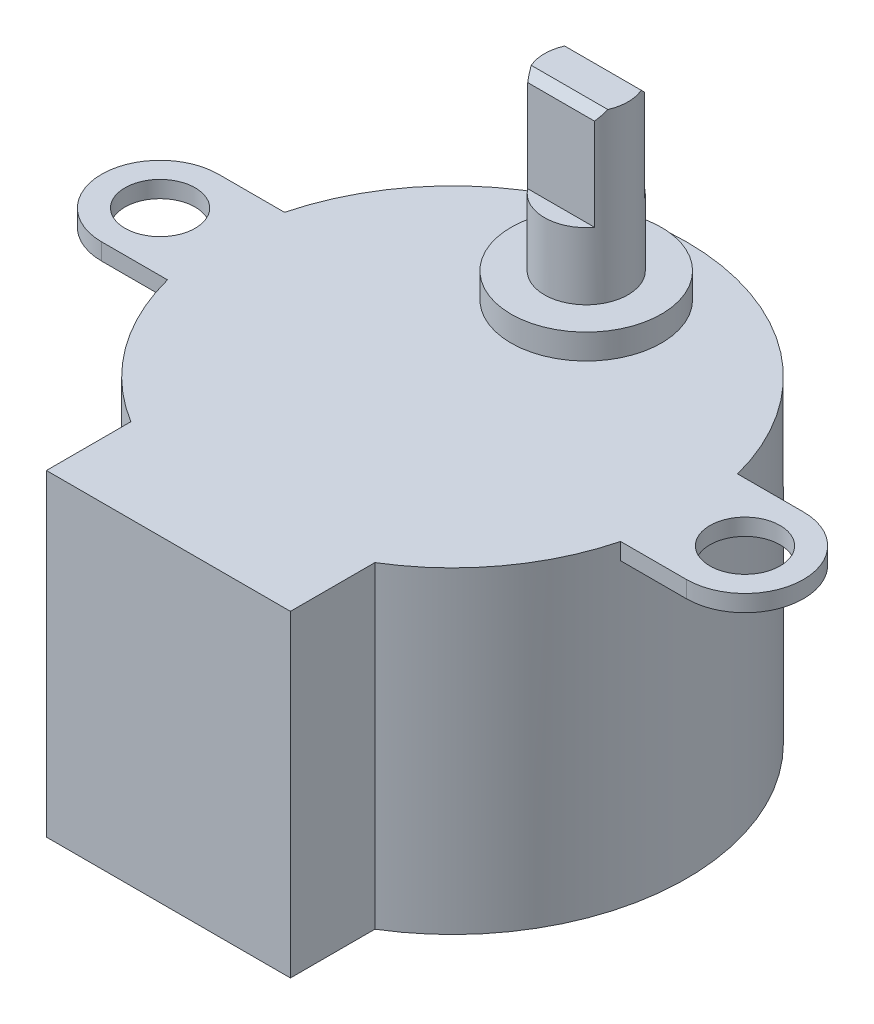
ISO-10303-21;
HEADER;
FILE_DESCRIPTION(('STEP AP214'),'2;1');
FILE_NAME('part.step','',(''),(''),'','','');
FILE_SCHEMA(('AUTOMOTIVE_DESIGN { 1 0 10303 214 1 1 1 1 }'));
ENDSEC;
DATA;
#1=APPLICATION_CONTEXT('core data for automotive mechanical design processes');
#2=APPLICATION_PROTOCOL_DEFINITION('international standard','automotive_design',2000,#1);
#3=PRODUCT_CONTEXT('',#1,'mechanical');
#4=PRODUCT('Part','Part','',(#3));
#5=PRODUCT_RELATED_PRODUCT_CATEGORY('part','',(#4));
#6=PRODUCT_DEFINITION_FORMATION('','',#4);
#7=PRODUCT_DEFINITION_CONTEXT('part definition',#1,'design');
#8=PRODUCT_DEFINITION('design','',#6,#7);
#9=PRODUCT_DEFINITION_SHAPE('','',#8);
#10=(LENGTH_UNIT() NAMED_UNIT(*) SI_UNIT(.MILLI.,.METRE.));
#11=(NAMED_UNIT(*) PLANE_ANGLE_UNIT() SI_UNIT($,.RADIAN.));
#12=(NAMED_UNIT(*) SI_UNIT($,.STERADIAN.) SOLID_ANGLE_UNIT());
#13=UNCERTAINTY_MEASURE_WITH_UNIT(LENGTH_MEASURE(1.E-05),#10,'distance_accuracy_value','');
#14=(GEOMETRIC_REPRESENTATION_CONTEXT(3) GLOBAL_UNCERTAINTY_ASSIGNED_CONTEXT((#13)) GLOBAL_UNIT_ASSIGNED_CONTEXT((#10,
#11,#12)) REPRESENTATION_CONTEXT('',''));
#15=CARTESIAN_POINT('',(0.,0.,0.));
#16=DIRECTION('',(0.,0.,1.));
#17=DIRECTION('',(1.,0.,0.));
#18=AXIS2_PLACEMENT_3D('',#15,#16,#17);
#19=CARTESIAN_POINT('',(0.,19.,0.));
#20=DIRECTION('',(0.,-1.,0.));
#21=DIRECTION('',(0.,0.,-1.));
#22=AXIS2_PLACEMENT_3D('',#19,#20,#21);
#23=CYLINDRICAL_SURFACE('',#22,14.);
#24=CARTESIAN_POINT('',(0.,19.,0.));
#25=DIRECTION('',(0.,1.,0.));
#26=DIRECTION('',(0.,0.,1.));
#27=AXIS2_PLACEMENT_3D('',#24,#25,#26);
#28=CIRCLE('',#27,14.);
#29=CARTESIAN_POINT('',(7.3,19.,11.9461290801665));
#30=VERTEX_POINT('',#29);
#31=CARTESIAN_POINT('',(13.555441711726,19.,3.5));
#32=VERTEX_POINT('',#31);
#33=EDGE_CURVE('E58',#30,#32,#28,.T.);
#34=ORIENTED_EDGE('',*,*,#33,.F.);
#35=DIRECTION('',(0.,1.,0.));
#36=VECTOR('',#35,1.);
#37=CARTESIAN_POINT('',(7.3,-15.449971238625,11.9461290801665));
#38=LINE('',#37,#36);
#39=CARTESIAN_POINT('',(7.3,0.,11.9461290801665));
#40=VERTEX_POINT('',#39);
#41=EDGE_CURVE('E197',#40,#30,#38,.T.);
#42=ORIENTED_EDGE('',*,*,#41,.F.);
#43=CARTESIAN_POINT('',(0.,0.,0.));
#44=DIRECTION('',(0.,1.,0.));
#45=DIRECTION('',(0.,0.,1.));
#46=AXIS2_PLACEMENT_3D('',#43,#44,#45);
#47=CIRCLE('',#46,14.);
#48=CARTESIAN_POINT('',(-7.3,0.,11.9461290801665));
#49=VERTEX_POINT('',#48);
#50=EDGE_CURVE('E345',#40,#49,#47,.T.);
#51=ORIENTED_EDGE('',*,*,#50,.T.);
#52=DIRECTION('',(0.,1.,0.));
#53=VECTOR('',#52,1.);
#54=CARTESIAN_POINT('',(-7.3,-15.449971238625,11.9461290801665));
#55=LINE('',#54,#53);
#56=CARTESIAN_POINT('',(-7.3,19.,11.9461290801665));
#57=VERTEX_POINT('',#56);
#58=EDGE_CURVE('E65',#49,#57,#55,.T.);
#59=ORIENTED_EDGE('',*,*,#58,.T.);
#60=CARTESIAN_POINT('',(-13.555441711726,19.,3.5));
#61=VERTEX_POINT('',#60);
#62=EDGE_CURVE('E189',#61,#57,#28,.T.);
#63=ORIENTED_EDGE('',*,*,#62,.F.);
#64=DIRECTION('',(0.,1.,0.));
#65=VECTOR('',#64,1.);
#66=CARTESIAN_POINT('',(-13.555441711726,18.,3.5));
#67=LINE('',#66,#65);
#68=CARTESIAN_POINT('',(-13.555441711726,18.,3.5));
#69=VERTEX_POINT('',#68);
#70=EDGE_CURVE('E301',#69,#61,#67,.T.);
#71=ORIENTED_EDGE('',*,*,#70,.F.);
#72=CARTESIAN_POINT('',(-4.05925293378573E-13,18.,0.));
#73=DIRECTION('',(0.,-1.,0.));
#74=DIRECTION('',(0.,0.,1.));
#75=AXIS2_PLACEMENT_3D('',#72,#73,#74);
#76=CIRCLE('',#75,13.9999999999996);
#77=CARTESIAN_POINT('',(-13.555441711726,18.,-3.5));
#78=VERTEX_POINT('',#77);
#79=EDGE_CURVE('E275',#69,#78,#76,.T.);
#80=ORIENTED_EDGE('',*,*,#79,.T.);
#81=DIRECTION('',(0.,1.,0.));
#82=VECTOR('',#81,1.);
#83=CARTESIAN_POINT('',(-13.555441711726,18.,-3.5));
#84=LINE('',#83,#82);
#85=CARTESIAN_POINT('',(-13.555441711726,19.,-3.5));
#86=VERTEX_POINT('',#85);
#87=EDGE_CURVE('E297',#78,#86,#84,.T.);
#88=ORIENTED_EDGE('',*,*,#87,.T.);
#89=CARTESIAN_POINT('',(13.555441711726,19.,-3.5));
#90=VERTEX_POINT('',#89);
#91=EDGE_CURVE('E249',#90,#86,#28,.T.);
#92=ORIENTED_EDGE('',*,*,#91,.F.);
#93=DIRECTION('',(0.,1.,0.));
#94=VECTOR('',#93,1.);
#95=CARTESIAN_POINT('',(13.555441711726,18.,-3.5));
#96=LINE('',#95,#94);
#97=CARTESIAN_POINT('',(13.555441711726,18.,-3.5));
#98=VERTEX_POINT('',#97);
#99=EDGE_CURVE('E349',#98,#90,#96,.T.);
#100=ORIENTED_EDGE('',*,*,#99,.F.);
#101=CARTESIAN_POINT('',(2.9316826744008E-13,18.,0.));
#102=DIRECTION('',(0.,-1.,0.));
#103=DIRECTION('',(0.,0.,-1.));
#104=AXIS2_PLACEMENT_3D('',#101,#102,#103);
#105=CIRCLE('',#104,13.9999999999997);
#106=CARTESIAN_POINT('',(13.555441711726,18.,3.5));
#107=VERTEX_POINT('',#106);
#108=EDGE_CURVE('E324',#98,#107,#105,.T.);
#109=ORIENTED_EDGE('',*,*,#108,.T.);
#110=DIRECTION('',(0.,1.,0.));
#111=VECTOR('',#110,1.);
#112=CARTESIAN_POINT('',(13.555441711726,18.,3.5));
#113=LINE('',#112,#111);
#114=EDGE_CURVE('E346',#107,#32,#113,.T.);
#115=ORIENTED_EDGE('',*,*,#114,.T.);
#116=EDGE_LOOP('',(#34,#42,#51,#59,#63,#71,#80,#88,#92,#100,#109,#115));
#117=FACE_BOUND('',#116,.T.);
#118=ADVANCED_FACE('F41',(#117),#23,.T.);
#119=CARTESIAN_POINT('',(0.,19.,0.));
#120=DIRECTION('',(0.,1.,0.));
#121=DIRECTION('',(0.,0.,1.));
#122=AXIS2_PLACEMENT_3D('',#119,#120,#121);
#123=PLANE('',#122);
#124=CARTESIAN_POINT('',(0.,19.,-8.));
#125=DIRECTION('',(0.,1.,0.));
#126=DIRECTION('',(0.,0.,1.));
#127=AXIS2_PLACEMENT_3D('',#124,#125,#126);
#128=CIRCLE('',#127,4.5);
#129=CARTESIAN_POINT('',(0.,19.,-3.5));
#130=VERTEX_POINT('',#129);
#131=EDGE_CURVE('E243',#130,#130,#128,.T.);
#132=ORIENTED_EDGE('',*,*,#131,.F.);
#133=EDGE_LOOP('',(#132));
#134=FACE_BOUND('',#133,.T.);
#135=ORIENTED_EDGE('',*,*,#91,.T.);
#136=DIRECTION('',(-1.,0.,0.));
#137=VECTOR('',#136,1.);
#138=CARTESIAN_POINT('',(-17.5,19.,-3.5));
#139=LINE('',#138,#137);
#140=CARTESIAN_POINT('',(-17.5,19.,-3.5));
#141=VERTEX_POINT('',#140);
#142=EDGE_CURVE('E271',#86,#141,#139,.T.);
#143=ORIENTED_EDGE('',*,*,#142,.T.);
#144=CARTESIAN_POINT('',(-17.5,19.,0.));
#145=DIRECTION('',(0.,1.,0.));
#146=DIRECTION('',(0.,0.,1.));
#147=AXIS2_PLACEMENT_3D('',#144,#145,#146);
#148=CIRCLE('',#147,3.5);
#149=CARTESIAN_POINT('',(-17.5,19.,3.5));
#150=VERTEX_POINT('',#149);
#151=EDGE_CURVE('E262',#141,#150,#148,.T.);
#152=ORIENTED_EDGE('',*,*,#151,.T.);
#153=DIRECTION('',(1.,0.,0.));
#154=VECTOR('',#153,1.);
#155=CARTESIAN_POINT('',(-17.5,19.,3.5));
#156=LINE('',#155,#154);
#157=EDGE_CURVE('E287',#150,#61,#156,.T.);
#158=ORIENTED_EDGE('',*,*,#157,.T.);
#159=ORIENTED_EDGE('',*,*,#62,.T.);
#160=DIRECTION('',(0.,0.,1.));
#161=VECTOR('',#160,1.);
#162=CARTESIAN_POINT('',(-7.3,19.,17.));
#163=LINE('',#162,#161);
#164=CARTESIAN_POINT('',(-7.3,19.,17.));
#165=VERTEX_POINT('',#164);
#166=EDGE_CURVE('E173',#57,#165,#163,.T.);
#167=ORIENTED_EDGE('',*,*,#166,.T.);
#168=DIRECTION('',(1.,0.,0.));
#169=VECTOR('',#168,1.);
#170=CARTESIAN_POINT('',(-7.3,19.,17.));
#171=LINE('',#170,#169);
#172=CARTESIAN_POINT('',(7.3,19.,17.));
#173=VERTEX_POINT('',#172);
#174=EDGE_CURVE('E188',#165,#173,#171,.T.);
#175=ORIENTED_EDGE('',*,*,#174,.T.);
#176=DIRECTION('',(0.,0.,-1.));
#177=VECTOR('',#176,1.);
#178=CARTESIAN_POINT('',(7.3,19.,11.9461290801665));
#179=LINE('',#178,#177);
#180=EDGE_CURVE('E191',#173,#30,#179,.T.);
#181=ORIENTED_EDGE('',*,*,#180,.T.);
#182=ORIENTED_EDGE('',*,*,#33,.T.);
#183=DIRECTION('',(1.,0.,0.));
#184=VECTOR('',#183,1.);
#185=CARTESIAN_POINT('',(17.5,19.,3.5));
#186=LINE('',#185,#184);
#187=CARTESIAN_POINT('',(17.5,19.,3.5));
#188=VERTEX_POINT('',#187);
#189=EDGE_CURVE('E320',#32,#188,#186,.T.);
#190=ORIENTED_EDGE('',*,*,#189,.T.);
#191=CARTESIAN_POINT('',(17.5,19.,0.));
#192=DIRECTION('',(0.,1.,0.));
#193=DIRECTION('',(0.,0.,-1.));
#194=AXIS2_PLACEMENT_3D('',#191,#192,#193);
#195=CIRCLE('',#194,3.5);
#196=CARTESIAN_POINT('',(17.5,19.,-3.5));
#197=VERTEX_POINT('',#196);
#198=EDGE_CURVE('E311',#188,#197,#195,.T.);
#199=ORIENTED_EDGE('',*,*,#198,.T.);
#200=DIRECTION('',(-1.,0.,0.));
#201=VECTOR('',#200,1.);
#202=CARTESIAN_POINT('',(17.5,19.,-3.5));
#203=LINE('',#202,#201);
#204=EDGE_CURVE('E336',#197,#90,#203,.T.);
#205=ORIENTED_EDGE('',*,*,#204,.T.);
#206=EDGE_LOOP('',(#135,#143,#152,#158,#159,#167,#175,#181,#182,#190,#199,#205));
#207=FACE_BOUND('',#206,.T.);
#208=CARTESIAN_POINT('',(17.5,19.,0.));
#209=DIRECTION('',(0.,1.,0.));
#210=DIRECTION('',(0.,0.,-1.));
#211=AXIS2_PLACEMENT_3D('',#208,#209,#210);
#212=CIRCLE('',#211,2.1);
#213=CARTESIAN_POINT('',(17.5,19.,-2.1));
#214=VERTEX_POINT('',#213);
#215=EDGE_CURVE('E296',#214,#214,#212,.T.);
#216=ORIENTED_EDGE('',*,*,#215,.F.);
#217=EDGE_LOOP('',(#216));
#218=FACE_BOUND('',#217,.T.);
#219=CARTESIAN_POINT('',(-17.5,19.,0.));
#220=DIRECTION('',(0.,1.,0.));
#221=DIRECTION('',(0.,0.,1.));
#222=AXIS2_PLACEMENT_3D('',#219,#220,#221);
#223=CIRCLE('',#222,2.1);
#224=CARTESIAN_POINT('',(-17.5,19.,2.1));
#225=VERTEX_POINT('',#224);
#226=EDGE_CURVE('E254',#225,#225,#223,.T.);
#227=ORIENTED_EDGE('',*,*,#226,.F.);
#228=EDGE_LOOP('',(#227));
#229=FACE_BOUND('',#228,.T.);
#230=ADVANCED_FACE('F185',(#134,#207,#218,#229),#123,.T.);
#231=CARTESIAN_POINT('',(0.,0.,0.));
#232=DIRECTION('',(0.,1.,0.));
#233=DIRECTION('',(0.,0.,1.));
#234=AXIS2_PLACEMENT_3D('',#231,#232,#233);
#235=PLANE('',#234);
#236=ORIENTED_EDGE('',*,*,#50,.F.);
#237=DIRECTION('',(0.,0.,1.));
#238=VECTOR('',#237,1.);
#239=CARTESIAN_POINT('',(7.3,0.,11.9461290801665));
#240=LINE('',#239,#238);
#241=CARTESIAN_POINT('',(7.3,0.,17.));
#242=VERTEX_POINT('',#241);
#243=EDGE_CURVE('E228',#40,#242,#240,.T.);
#244=ORIENTED_EDGE('',*,*,#243,.T.);
#245=DIRECTION('',(-1.,0.,0.));
#246=VECTOR('',#245,1.);
#247=CARTESIAN_POINT('',(-7.3,0.,17.));
#248=LINE('',#247,#246);
#249=CARTESIAN_POINT('',(-7.3,0.,17.));
#250=VERTEX_POINT('',#249);
#251=EDGE_CURVE('E664',#242,#250,#248,.T.);
#252=ORIENTED_EDGE('',*,*,#251,.T.);
#253=DIRECTION('',(0.,0.,-1.));
#254=VECTOR('',#253,1.);
#255=CARTESIAN_POINT('',(-7.3,0.,17.));
#256=LINE('',#255,#254);
#257=EDGE_CURVE('E175',#250,#49,#256,.T.);
#258=ORIENTED_EDGE('',*,*,#257,.T.);
#259=EDGE_LOOP('',(#236,#244,#252,#258));
#260=FACE_BOUND('',#259,.T.);
#261=ADVANCED_FACE('F414',(#260),#235,.F.);
#262=CARTESIAN_POINT('',(17.5,18.,0.));
#263=DIRECTION('',(0.,1.,0.));
#264=DIRECTION('',(0.,0.,1.));
#265=AXIS2_PLACEMENT_3D('',#262,#263,#264);
#266=CYLINDRICAL_SURFACE('',#265,3.5);
#267=ORIENTED_EDGE('',*,*,#198,.F.);
#268=DIRECTION('',(0.,1.,0.));
#269=VECTOR('',#268,1.);
#270=CARTESIAN_POINT('',(17.5,18.,3.5));
#271=LINE('',#270,#269);
#272=CARTESIAN_POINT('',(17.5,18.,3.5));
#273=VERTEX_POINT('',#272);
#274=EDGE_CURVE('E342',#273,#188,#271,.T.);
#275=ORIENTED_EDGE('',*,*,#274,.F.);
#276=CARTESIAN_POINT('',(17.5,18.,0.));
#277=DIRECTION('',(0.,1.,0.));
#278=DIRECTION('',(0.,0.,-1.));
#279=AXIS2_PLACEMENT_3D('',#276,#277,#278);
#280=CIRCLE('',#279,3.5);
#281=CARTESIAN_POINT('',(17.5,18.,-3.5));
#282=VERTEX_POINT('',#281);
#283=EDGE_CURVE('E315',#273,#282,#280,.T.);
#284=ORIENTED_EDGE('',*,*,#283,.T.);
#285=DIRECTION('',(0.,1.,0.));
#286=VECTOR('',#285,1.);
#287=CARTESIAN_POINT('',(17.5,18.,-3.5));
#288=LINE('',#287,#286);
#289=EDGE_CURVE('E332',#282,#197,#288,.T.);
#290=ORIENTED_EDGE('',*,*,#289,.T.);
#291=EDGE_LOOP('',(#267,#275,#284,#290));
#292=FACE_BOUND('',#291,.T.);
#293=ADVANCED_FACE('F464',(#292),#266,.T.);
#294=CARTESIAN_POINT('',(17.5,18.,3.5));
#295=DIRECTION('',(0.,0.,1.));
#296=DIRECTION('',(1.,0.,0.));
#297=AXIS2_PLACEMENT_3D('',#294,#295,#296);
#298=PLANE('',#297);
#299=ORIENTED_EDGE('',*,*,#189,.F.);
#300=ORIENTED_EDGE('',*,*,#114,.F.);
#301=DIRECTION('',(1.,0.,0.));
#302=VECTOR('',#301,1.);
#303=CARTESIAN_POINT('',(17.5,18.,3.5));
#304=LINE('',#303,#302);
#305=EDGE_CURVE('E328',#107,#273,#304,.T.);
#306=ORIENTED_EDGE('',*,*,#305,.T.);
#307=ORIENTED_EDGE('',*,*,#274,.T.);
#308=EDGE_LOOP('',(#299,#300,#306,#307));
#309=FACE_BOUND('',#308,.T.);
#310=ADVANCED_FACE('F608',(#309),#298,.T.);
#311=CARTESIAN_POINT('',(17.5,18.,-3.5));
#312=DIRECTION('',(0.,0.,-1.));
#313=DIRECTION('',(-1.,0.,0.));
#314=AXIS2_PLACEMENT_3D('',#311,#312,#313);
#315=PLANE('',#314);
#316=ORIENTED_EDGE('',*,*,#204,.F.);
#317=ORIENTED_EDGE('',*,*,#289,.F.);
#318=DIRECTION('',(-1.,0.,0.));
#319=VECTOR('',#318,1.);
#320=CARTESIAN_POINT('',(17.5,18.,-3.5));
#321=LINE('',#320,#319);
#322=EDGE_CURVE('E319',#282,#98,#321,.T.);
#323=ORIENTED_EDGE('',*,*,#322,.T.);
#324=ORIENTED_EDGE('',*,*,#99,.T.);
#325=EDGE_LOOP('',(#316,#317,#323,#324));
#326=FACE_BOUND('',#325,.T.);
#327=ADVANCED_FACE('F599',(#326),#315,.T.);
#328=CARTESIAN_POINT('',(17.5,18.,0.));
#329=DIRECTION('',(0.,-1.,0.));
#330=DIRECTION('',(0.,0.,-1.));
#331=AXIS2_PLACEMENT_3D('',#328,#329,#330);
#332=PLANE('',#331);
#333=CARTESIAN_POINT('',(17.5,18.,0.));
#334=DIRECTION('',(0.,1.,0.));
#335=DIRECTION('',(0.,0.,-1.));
#336=AXIS2_PLACEMENT_3D('',#333,#334,#335);
#337=CIRCLE('',#336,2.1);
#338=CARTESIAN_POINT('',(17.5,18.,-2.1));
#339=VERTEX_POINT('',#338);
#340=EDGE_CURVE('E307',#339,#339,#337,.T.);
#341=ORIENTED_EDGE('',*,*,#340,.T.);
#342=EDGE_LOOP('',(#341));
#343=FACE_BOUND('',#342,.T.);
#344=ORIENTED_EDGE('',*,*,#283,.F.);
#345=ORIENTED_EDGE('',*,*,#305,.F.);
#346=ORIENTED_EDGE('',*,*,#108,.F.);
#347=ORIENTED_EDGE('',*,*,#322,.F.);
#348=EDGE_LOOP('',(#344,#345,#346,#347));
#349=FACE_BOUND('',#348,.T.);
#350=ADVANCED_FACE('F590',(#343,#349),#332,.T.);
#351=CARTESIAN_POINT('',(17.5,18.,0.));
#352=DIRECTION('',(0.,1.,0.));
#353=DIRECTION('',(0.,0.,1.));
#354=AXIS2_PLACEMENT_3D('',#351,#352,#353);
#355=CYLINDRICAL_SURFACE('',#354,2.1);
#356=ORIENTED_EDGE('',*,*,#340,.F.);
#357=EDGE_LOOP('',(#356));
#358=FACE_BOUND('',#357,.T.);
#359=ORIENTED_EDGE('',*,*,#215,.T.);
#360=EDGE_LOOP('',(#359));
#361=FACE_BOUND('',#360,.T.);
#362=ADVANCED_FACE('F581',(#358,#361),#355,.F.);
#363=CARTESIAN_POINT('',(-17.5,18.,0.));
#364=DIRECTION('',(0.,1.,0.));
#365=DIRECTION('',(0.,0.,1.));
#366=AXIS2_PLACEMENT_3D('',#363,#364,#365);
#367=CYLINDRICAL_SURFACE('',#366,3.5);
#368=ORIENTED_EDGE('',*,*,#151,.F.);
#369=DIRECTION('',(0.,1.,0.));
#370=VECTOR('',#369,1.);
#371=CARTESIAN_POINT('',(-17.5,18.,-3.5));
#372=LINE('',#371,#370);
#373=CARTESIAN_POINT('',(-17.5,18.,-3.5));
#374=VERTEX_POINT('',#373);
#375=EDGE_CURVE('E293',#374,#141,#372,.T.);
#376=ORIENTED_EDGE('',*,*,#375,.F.);
#377=CARTESIAN_POINT('',(-17.5,18.,0.));
#378=DIRECTION('',(0.,1.,0.));
#379=DIRECTION('',(0.,0.,1.));
#380=AXIS2_PLACEMENT_3D('',#377,#378,#379);
#381=CIRCLE('',#380,3.5);
#382=CARTESIAN_POINT('',(-17.5,18.,3.5));
#383=VERTEX_POINT('',#382);
#384=EDGE_CURVE('E266',#374,#383,#381,.T.);
#385=ORIENTED_EDGE('',*,*,#384,.T.);
#386=DIRECTION('',(0.,1.,0.));
#387=VECTOR('',#386,1.);
#388=CARTESIAN_POINT('',(-17.5,18.,3.5));
#389=LINE('',#388,#387);
#390=EDGE_CURVE('E283',#383,#150,#389,.T.);
#391=ORIENTED_EDGE('',*,*,#390,.T.);
#392=EDGE_LOOP('',(#368,#376,#385,#391));
#393=FACE_BOUND('',#392,.T.);
#394=ADVANCED_FACE('F572',(#393),#367,.T.);
#395=CARTESIAN_POINT('',(-17.5,18.,-3.5));
#396=DIRECTION('',(0.,0.,-1.));
#397=DIRECTION('',(-1.,0.,0.));
#398=AXIS2_PLACEMENT_3D('',#395,#396,#397);
#399=PLANE('',#398);
#400=ORIENTED_EDGE('',*,*,#142,.F.);
#401=ORIENTED_EDGE('',*,*,#87,.F.);
#402=DIRECTION('',(-1.,0.,0.));
#403=VECTOR('',#402,1.);
#404=CARTESIAN_POINT('',(-17.5,18.,-3.5));
#405=LINE('',#404,#403);
#406=EDGE_CURVE('E279',#78,#374,#405,.T.);
#407=ORIENTED_EDGE('',*,*,#406,.T.);
#408=ORIENTED_EDGE('',*,*,#375,.T.);
#409=EDGE_LOOP('',(#400,#401,#407,#408));
#410=FACE_BOUND('',#409,.T.);
#411=ADVANCED_FACE('F563',(#410),#399,.T.);
#412=CARTESIAN_POINT('',(-17.5,18.,3.5));
#413=DIRECTION('',(0.,0.,1.));
#414=DIRECTION('',(1.,0.,0.));
#415=AXIS2_PLACEMENT_3D('',#412,#413,#414);
#416=PLANE('',#415);
#417=ORIENTED_EDGE('',*,*,#157,.F.);
#418=ORIENTED_EDGE('',*,*,#390,.F.);
#419=DIRECTION('',(1.,0.,0.));
#420=VECTOR('',#419,1.);
#421=CARTESIAN_POINT('',(-17.5,18.,3.5));
#422=LINE('',#421,#420);
#423=EDGE_CURVE('E270',#383,#69,#422,.T.);
#424=ORIENTED_EDGE('',*,*,#423,.T.);
#425=ORIENTED_EDGE('',*,*,#70,.T.);
#426=EDGE_LOOP('',(#417,#418,#424,#425));
#427=FACE_BOUND('',#426,.T.);
#428=ADVANCED_FACE('F554',(#427),#416,.T.);
#429=CARTESIAN_POINT('',(-17.5,18.,0.));
#430=DIRECTION('',(0.,1.,0.));
#431=DIRECTION('',(0.,0.,1.));
#432=AXIS2_PLACEMENT_3D('',#429,#430,#431);
#433=PLANE('',#432);
#434=CARTESIAN_POINT('',(-17.5,18.,0.));
#435=DIRECTION('',(0.,1.,0.));
#436=DIRECTION('',(0.,0.,1.));
#437=AXIS2_PLACEMENT_3D('',#434,#435,#436);
#438=CIRCLE('',#437,2.1);
#439=CARTESIAN_POINT('',(-17.5,18.,2.1));
#440=VERTEX_POINT('',#439);
#441=EDGE_CURVE('E258',#440,#440,#438,.T.);
#442=ORIENTED_EDGE('',*,*,#441,.T.);
#443=EDGE_LOOP('',(#442));
#444=FACE_BOUND('',#443,.T.);
#445=ORIENTED_EDGE('',*,*,#384,.F.);
#446=ORIENTED_EDGE('',*,*,#406,.F.);
#447=ORIENTED_EDGE('',*,*,#79,.F.);
#448=ORIENTED_EDGE('',*,*,#423,.F.);
#449=EDGE_LOOP('',(#445,#446,#447,#448));
#450=FACE_BOUND('',#449,.T.);
#451=ADVANCED_FACE('F545',(#444,#450),#433,.F.);
#452=CARTESIAN_POINT('',(-17.5,18.,0.));
#453=DIRECTION('',(0.,1.,0.));
#454=DIRECTION('',(0.,0.,1.));
#455=AXIS2_PLACEMENT_3D('',#452,#453,#454);
#456=CYLINDRICAL_SURFACE('',#455,2.1);
#457=ORIENTED_EDGE('',*,*,#441,.F.);
#458=EDGE_LOOP('',(#457));
#459=FACE_BOUND('',#458,.T.);
#460=ORIENTED_EDGE('',*,*,#226,.T.);
#461=EDGE_LOOP('',(#460));
#462=FACE_BOUND('',#461,.T.);
#463=ADVANCED_FACE('F536',(#459,#462),#456,.F.);
#464=CARTESIAN_POINT('',(0.,20.5,-8.));
#465=DIRECTION('',(0.,-1.,0.));
#466=DIRECTION('',(0.,0.,-1.));
#467=AXIS2_PLACEMENT_3D('',#464,#465,#466);
#468=CYLINDRICAL_SURFACE('',#467,4.5);
#469=CARTESIAN_POINT('',(0.,20.5,-8.));
#470=DIRECTION('',(0.,1.,0.));
#471=DIRECTION('',(0.,0.,1.));
#472=AXIS2_PLACEMENT_3D('',#469,#470,#471);
#473=CIRCLE('',#472,4.5);
#474=CARTESIAN_POINT('',(0.,20.5,-3.5));
#475=VERTEX_POINT('',#474);
#476=EDGE_CURVE('E250',#475,#475,#473,.T.);
#477=ORIENTED_EDGE('',*,*,#476,.F.);
#478=EDGE_LOOP('',(#477));
#479=FACE_BOUND('',#478,.T.);
#480=ORIENTED_EDGE('',*,*,#131,.T.);
#481=EDGE_LOOP('',(#480));
#482=FACE_BOUND('',#481,.T.);
#483=ADVANCED_FACE('F527',(#479,#482),#468,.T.);
#484=CARTESIAN_POINT('',(0.,20.5,-8.));
#485=DIRECTION('',(0.,1.,0.));
#486=DIRECTION('',(0.,0.,1.));
#487=AXIS2_PLACEMENT_3D('',#484,#485,#486);
#488=PLANE('',#487);
#489=CARTESIAN_POINT('',(0.,20.5,-8.));
#490=DIRECTION('',(0.,1.,0.));
#491=DIRECTION('',(0.,0.,1.));
#492=AXIS2_PLACEMENT_3D('',#489,#490,#491);
#493=CIRCLE('',#492,2.5);
#494=CARTESIAN_POINT('',(0.,20.5,-5.5));
#495=VERTEX_POINT('',#494);
#496=EDGE_CURVE('E244',#495,#495,#493,.T.);
#497=ORIENTED_EDGE('',*,*,#496,.F.);
#498=EDGE_LOOP('',(#497));
#499=FACE_BOUND('',#498,.T.);
#500=ORIENTED_EDGE('',*,*,#476,.T.);
#501=EDGE_LOOP('',(#500));
#502=FACE_BOUND('',#501,.T.);
#503=ADVANCED_FACE('F520',(#499,#502),#488,.T.);
#504=CARTESIAN_POINT('',(0.,30.5,-8.));
#505=DIRECTION('',(0.,-1.,0.));
#506=DIRECTION('',(0.,0.,-1.));
#507=AXIS2_PLACEMENT_3D('',#504,#505,#506);
#508=CYLINDRICAL_SURFACE('',#507,2.5);
#509=DIRECTION('',(0.,1.,0.));
#510=VECTOR('',#509,1.);
#511=CARTESIAN_POINT('',(-2.00000000000001,24.5,-6.5));
#512=LINE('',#511,#510);
#513=CARTESIAN_POINT('',(-2.00000000000001,24.5,-6.5));
#514=VERTEX_POINT('',#513);
#515=CARTESIAN_POINT('',(-2.00000000000001,30.,-6.5));
#516=VERTEX_POINT('',#515);
#517=EDGE_CURVE('E211',#514,#516,#512,.T.);
#518=ORIENTED_EDGE('',*,*,#517,.T.);
#519=CARTESIAN_POINT('',(0.,31.5,-8.));
#520=DIRECTION('',(0.,0.707106781186552,0.707106781186542));
#521=DIRECTION('',(0.,-0.707106781186543,0.707106781186552));
#522=AXIS2_PLACEMENT_3D('',#519,#520,#521);
#523=ELLIPSE('',#522,3.53553390593271,2.5);
#524=CARTESIAN_POINT('',(-2.29128784747792,30.5,-7.00000000000001));
#525=VERTEX_POINT('',#524);
#526=EDGE_CURVE('E371',#516,#525,#523,.F.);
#527=ORIENTED_EDGE('',*,*,#526,.T.);
#528=CARTESIAN_POINT('',(0.,30.5,-8.));
#529=DIRECTION('',(0.,1.,0.));
#530=DIRECTION('',(0.,0.,1.));
#531=AXIS2_PLACEMENT_3D('',#528,#529,#530);
#532=CIRCLE('',#531,2.5);
#533=CARTESIAN_POINT('',(-2.29128784747792,30.5,-8.99999999999999));
#534=VERTEX_POINT('',#533);
#535=EDGE_CURVE('E220',#534,#525,#532,.T.);
#536=ORIENTED_EDGE('',*,*,#535,.F.);
#537=CARTESIAN_POINT('',(0.,31.5,-8.));
#538=DIRECTION('',(0.,0.707106781186552,-0.707106781186542));
#539=DIRECTION('',(0.,-0.707106781186543,-0.707106781186552));
#540=AXIS2_PLACEMENT_3D('',#537,#538,#539);
#541=ELLIPSE('',#540,3.53553390593271,2.5);
#542=CARTESIAN_POINT('',(-2.00000000000001,30.,-9.5));
#543=VERTEX_POINT('',#542);
#544=EDGE_CURVE('E362',#534,#543,#541,.F.);
#545=ORIENTED_EDGE('',*,*,#544,.T.);
#546=DIRECTION('',(0.,1.,0.));
#547=VECTOR('',#546,1.);
#548=CARTESIAN_POINT('',(-2.00000000000001,24.5,-9.5));
#549=LINE('',#548,#547);
#550=CARTESIAN_POINT('',(-2.00000000000001,24.5,-9.5));
#551=VERTEX_POINT('',#550);
#552=EDGE_CURVE('E215',#551,#543,#549,.T.);
#553=ORIENTED_EDGE('',*,*,#552,.F.);
#554=CARTESIAN_POINT('',(0.,24.5,-8.));
#555=DIRECTION('',(0.,1.,0.));
#556=DIRECTION('',(0.,0.,-1.));
#557=AXIS2_PLACEMENT_3D('',#554,#555,#556);
#558=CIRCLE('',#557,2.50000000000001);
#559=CARTESIAN_POINT('',(2.00000000000001,24.5,-9.5));
#560=VERTEX_POINT('',#559);
#561=EDGE_CURVE('E207',#560,#551,#558,.T.);
#562=ORIENTED_EDGE('',*,*,#561,.F.);
#563=DIRECTION('',(0.,1.,0.));
#564=VECTOR('',#563,1.);
#565=CARTESIAN_POINT('',(2.00000000000001,24.5,-9.5));
#566=LINE('',#565,#564);
#567=CARTESIAN_POINT('',(2.00000000000001,30.,-9.5));
#568=VERTEX_POINT('',#567);
#569=EDGE_CURVE('E216',#560,#568,#566,.T.);
#570=ORIENTED_EDGE('',*,*,#569,.T.);
#571=CARTESIAN_POINT('',(0.,31.5,-8.));
#572=DIRECTION('',(0.,0.707106781186552,-0.707106781186542));
#573=DIRECTION('',(0.,-0.707106781186543,-0.707106781186552));
#574=AXIS2_PLACEMENT_3D('',#571,#572,#573);
#575=ELLIPSE('',#574,3.53553390593271,2.5);
#576=CARTESIAN_POINT('',(2.29128784747792,30.5,-8.99999999999999));
#577=VERTEX_POINT('',#576);
#578=EDGE_CURVE('E365',#568,#577,#575,.F.);
#579=ORIENTED_EDGE('',*,*,#578,.T.);
#580=CARTESIAN_POINT('',(2.29128784747792,30.5,-7.00000000000001));
#581=VERTEX_POINT('',#580);
#582=EDGE_CURVE('E239',#581,#577,#532,.T.);
#583=ORIENTED_EDGE('',*,*,#582,.F.);
#584=CARTESIAN_POINT('',(0.,31.5,-8.));
#585=DIRECTION('',(0.,0.707106781186552,0.707106781186542));
#586=DIRECTION('',(0.,-0.707106781186543,0.707106781186552));
#587=AXIS2_PLACEMENT_3D('',#584,#585,#586);
#588=ELLIPSE('',#587,3.53553390593271,2.5);
#589=CARTESIAN_POINT('',(2.00000000000001,30.,-6.5));
#590=VERTEX_POINT('',#589);
#591=EDGE_CURVE('E368',#581,#590,#588,.F.);
#592=ORIENTED_EDGE('',*,*,#591,.T.);
#593=DIRECTION('',(0.,1.,0.));
#594=VECTOR('',#593,1.);
#595=CARTESIAN_POINT('',(2.00000000000001,24.5,-6.5));
#596=LINE('',#595,#594);
#597=CARTESIAN_POINT('',(2.00000000000001,24.5,-6.5));
#598=VERTEX_POINT('',#597);
#599=EDGE_CURVE('E232',#598,#590,#596,.T.);
#600=ORIENTED_EDGE('',*,*,#599,.F.);
#601=CARTESIAN_POINT('',(0.,24.5,-8.));
#602=DIRECTION('',(0.,1.,0.));
#603=DIRECTION('',(0.,0.,1.));
#604=AXIS2_PLACEMENT_3D('',#601,#602,#603);
#605=CIRCLE('',#604,2.50000000000001);
#606=EDGE_CURVE('E224',#514,#598,#605,.T.);
#607=ORIENTED_EDGE('',*,*,#606,.F.);
#608=EDGE_LOOP('',(#518,#527,#536,#545,#553,#562,#570,#579,#583,#592,#600,#607));
#609=FACE_BOUND('',#608,.T.);
#610=ORIENTED_EDGE('',*,*,#496,.T.);
#611=EDGE_LOOP('',(#610));
#612=FACE_BOUND('',#611,.T.);
#613=ADVANCED_FACE('F387',(#609,#612),#508,.T.);
#614=CARTESIAN_POINT('',(0.,30.5,-8.));
#615=DIRECTION('',(0.,1.,0.));
#616=DIRECTION('',(0.,0.,1.));
#617=AXIS2_PLACEMENT_3D('',#614,#615,#616);
#618=PLANE('',#617);
#619=ORIENTED_EDGE('',*,*,#535,.T.);
#620=DIRECTION('',(1.,0.,0.));
#621=VECTOR('',#620,1.);
#622=CARTESIAN_POINT('',(2.,30.5,-7.00000000000001));
#623=LINE('',#622,#621);
#624=EDGE_CURVE('E51',#525,#581,#623,.T.);
#625=ORIENTED_EDGE('',*,*,#624,.T.);
#626=ORIENTED_EDGE('',*,*,#582,.T.);
#627=DIRECTION('',(-1.,0.,0.));
#628=VECTOR('',#627,1.);
#629=CARTESIAN_POINT('',(-2.,30.5,-8.99999999999999));
#630=LINE('',#629,#628);
#631=EDGE_CURVE('E374',#577,#534,#630,.T.);
#632=ORIENTED_EDGE('',*,*,#631,.T.);
#633=EDGE_LOOP('',(#619,#625,#626,#632));
#634=FACE_BOUND('',#633,.T.);
#635=ADVANCED_FACE('F381',(#634),#618,.T.);
#636=CARTESIAN_POINT('',(-2.00000000000001,24.5,-6.5));
#637=DIRECTION('',(0.,0.,-1.));
#638=DIRECTION('',(-1.,0.,0.));
#639=AXIS2_PLACEMENT_3D('',#636,#637,#638);
#640=PLANE('',#639);
#641=ORIENTED_EDGE('',*,*,#599,.T.);
#642=DIRECTION('',(-1.,0.,0.));
#643=VECTOR('',#642,1.);
#644=CARTESIAN_POINT('',(-2.00000000000001,30.,-6.5));
#645=LINE('',#644,#643);
#646=EDGE_CURVE('E248',#590,#516,#645,.T.);
#647=ORIENTED_EDGE('',*,*,#646,.T.);
#648=ORIENTED_EDGE('',*,*,#517,.F.);
#649=DIRECTION('',(-1.,0.,0.));
#650=VECTOR('',#649,1.);
#651=CARTESIAN_POINT('',(-2.00000000000001,24.5,-6.5));
#652=LINE('',#651,#650);
#653=EDGE_CURVE('E227',#598,#514,#652,.T.);
#654=ORIENTED_EDGE('',*,*,#653,.F.);
#655=EDGE_LOOP('',(#641,#647,#648,#654));
#656=FACE_BOUND('',#655,.T.);
#657=ADVANCED_FACE('F393',(#656),#640,.F.);
#658=CARTESIAN_POINT('',(0.,24.5,-8.));
#659=DIRECTION('',(0.,1.,0.));
#660=DIRECTION('',(0.,0.,1.));
#661=AXIS2_PLACEMENT_3D('',#658,#659,#660);
#662=PLANE('',#661);
#663=ORIENTED_EDGE('',*,*,#606,.T.);
#664=ORIENTED_EDGE('',*,*,#653,.T.);
#665=EDGE_LOOP('',(#663,#664));
#666=FACE_BOUND('',#665,.T.);
#667=ADVANCED_FACE('F397',(#666),#662,.T.);
#668=CARTESIAN_POINT('',(-2.00000000000001,24.5,-9.5));
#669=DIRECTION('',(0.,0.,1.));
#670=DIRECTION('',(1.,0.,0.));
#671=AXIS2_PLACEMENT_3D('',#668,#669,#670);
#672=PLANE('',#671);
#673=ORIENTED_EDGE('',*,*,#552,.T.);
#674=DIRECTION('',(1.,0.,0.));
#675=VECTOR('',#674,1.);
#676=CARTESIAN_POINT('',(2.00000000000001,30.,-9.5));
#677=LINE('',#676,#675);
#678=EDGE_CURVE('E11',#543,#568,#677,.T.);
#679=ORIENTED_EDGE('',*,*,#678,.T.);
#680=ORIENTED_EDGE('',*,*,#569,.F.);
#681=DIRECTION('',(1.,0.,0.));
#682=VECTOR('',#681,1.);
#683=CARTESIAN_POINT('',(-2.00000000000001,24.5,-9.5));
#684=LINE('',#683,#682);
#685=EDGE_CURVE('E210',#551,#560,#684,.T.);
#686=ORIENTED_EDGE('',*,*,#685,.F.);
#687=EDGE_LOOP('',(#673,#679,#680,#686));
#688=FACE_BOUND('',#687,.T.);
#689=ADVANCED_FACE('F399',(#688),#672,.F.);
#690=CARTESIAN_POINT('',(0.,24.5,-8.));
#691=DIRECTION('',(0.,-1.,0.));
#692=DIRECTION('',(0.,0.,-1.));
#693=AXIS2_PLACEMENT_3D('',#690,#691,#692);
#694=PLANE('',#693);
#695=ORIENTED_EDGE('',*,*,#561,.T.);
#696=ORIENTED_EDGE('',*,*,#685,.T.);
#697=EDGE_LOOP('',(#695,#696));
#698=FACE_BOUND('',#697,.T.);
#699=ADVANCED_FACE('F405',(#698),#694,.F.);
#700=CARTESIAN_POINT('',(-2.00000000000001,30.,-6.5));
#701=DIRECTION('',(0.,0.707106781186552,0.707106781186542));
#702=DIRECTION('',(1.,0.,0.));
#703=AXIS2_PLACEMENT_3D('',#700,#701,#702);
#704=PLANE('',#703);
#705=ORIENTED_EDGE('',*,*,#591,.F.);
#706=ORIENTED_EDGE('',*,*,#624,.F.);
#707=ORIENTED_EDGE('',*,*,#526,.F.);
#708=ORIENTED_EDGE('',*,*,#646,.F.);
#709=EDGE_LOOP('',(#705,#706,#707,#708));
#710=FACE_BOUND('',#709,.T.);
#711=ADVANCED_FACE('F391',(#710),#704,.T.);
#712=CARTESIAN_POINT('',(-2.00000000000001,30.,-9.5));
#713=DIRECTION('',(0.,0.707106781186552,-0.707106781186542));
#714=DIRECTION('',(-1.,0.,0.));
#715=AXIS2_PLACEMENT_3D('',#712,#713,#714);
#716=PLANE('',#715);
#717=ORIENTED_EDGE('',*,*,#544,.F.);
#718=ORIENTED_EDGE('',*,*,#631,.F.);
#719=ORIENTED_EDGE('',*,*,#578,.F.);
#720=ORIENTED_EDGE('',*,*,#678,.F.);
#721=EDGE_LOOP('',(#717,#718,#719,#720));
#722=FACE_BOUND('',#721,.T.);
#723=ADVANCED_FACE('F44',(#722),#716,.T.);
#724=CARTESIAN_POINT('',(7.3,-15.449971238625,11.9461290801665));
#725=DIRECTION('',(1.,0.,0.));
#726=DIRECTION('',(0.,0.,-1.));
#727=AXIS2_PLACEMENT_3D('',#724,#725,#726);
#728=PLANE('',#727);
#729=ORIENTED_EDGE('',*,*,#243,.F.);
#730=ORIENTED_EDGE('',*,*,#41,.T.);
#731=ORIENTED_EDGE('',*,*,#180,.F.);
#732=DIRECTION('',(0.,1.,0.));
#733=VECTOR('',#732,1.);
#734=CARTESIAN_POINT('',(7.3,-15.449971238625,17.));
#735=LINE('',#734,#733);
#736=EDGE_CURVE('E180',#242,#173,#735,.T.);
#737=ORIENTED_EDGE('',*,*,#736,.F.);
#738=EDGE_LOOP('',(#729,#730,#731,#737));
#739=FACE_BOUND('',#738,.T.);
#740=ADVANCED_FACE('F426',(#739),#728,.T.);
#741=CARTESIAN_POINT('',(-7.3,-15.449971238625,17.));
#742=DIRECTION('',(0.,0.,1.));
#743=DIRECTION('',(1.,0.,0.));
#744=AXIS2_PLACEMENT_3D('',#741,#742,#743);
#745=PLANE('',#744);
#746=ORIENTED_EDGE('',*,*,#251,.F.);
#747=ORIENTED_EDGE('',*,*,#736,.T.);
#748=ORIENTED_EDGE('',*,*,#174,.F.);
#749=DIRECTION('',(0.,1.,0.));
#750=VECTOR('',#749,1.);
#751=CARTESIAN_POINT('',(-7.3,-15.449971238625,17.));
#752=LINE('',#751,#750);
#753=EDGE_CURVE('E170',#250,#165,#752,.T.);
#754=ORIENTED_EDGE('',*,*,#753,.F.);
#755=EDGE_LOOP('',(#746,#747,#748,#754));
#756=FACE_BOUND('',#755,.T.);
#757=ADVANCED_FACE('F193',(#756),#745,.T.);
#758=CARTESIAN_POINT('',(-7.3,-15.449971238625,17.));
#759=DIRECTION('',(-1.,0.,0.));
#760=DIRECTION('',(0.,0.,1.));
#761=AXIS2_PLACEMENT_3D('',#758,#759,#760);
#762=PLANE('',#761);
#763=ORIENTED_EDGE('',*,*,#257,.F.);
#764=ORIENTED_EDGE('',*,*,#753,.T.);
#765=ORIENTED_EDGE('',*,*,#166,.F.);
#766=ORIENTED_EDGE('',*,*,#58,.F.);
#767=EDGE_LOOP('',(#763,#764,#765,#766));
#768=FACE_BOUND('',#767,.T.);
#769=ADVANCED_FACE('F172',(#768),#762,.T.);
#770=CLOSED_SHELL('',(#118,#230,#261,#293,#310,#327,#350,#362,#394,#411,#428,#451,#463,#483,
#503,#613,#635,#657,#667,#689,#699,#711,#723,#740,#757,#769));
#771=MANIFOLD_SOLID_BREP('B2',#770);
#772=ADVANCED_BREP_SHAPE_REPRESENTATION('',(#18,#771),#14);
#773=SHAPE_DEFINITION_REPRESENTATION(#9,#772);
ENDSEC;
END-ISO-10303-21;
